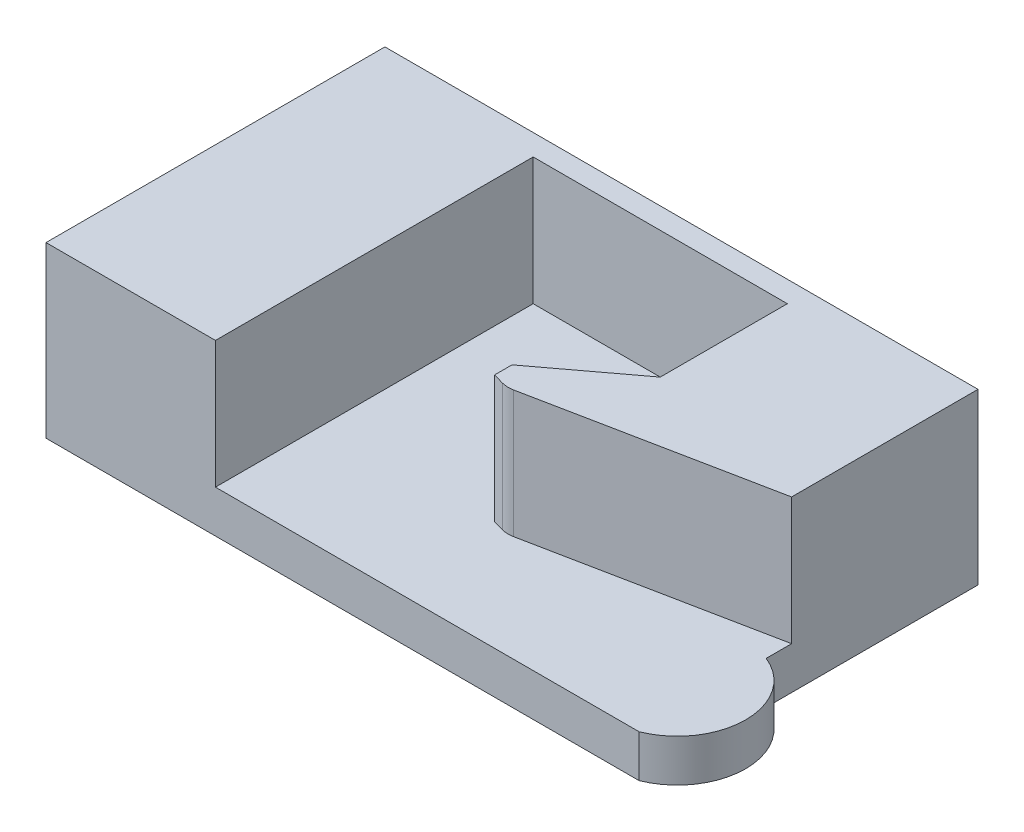
ISO-10303-21;
HEADER;
FILE_DESCRIPTION(('STEP AP214'),'2;1');
FILE_NAME('part.step','',(''),(''),'','','');
FILE_SCHEMA(('AUTOMOTIVE_DESIGN { 1 0 10303 214 1 1 1 1 }'));
ENDSEC;
DATA;
#1=APPLICATION_CONTEXT('core data for automotive mechanical design processes');
#2=APPLICATION_PROTOCOL_DEFINITION('international standard','automotive_design',2000,#1);
#3=PRODUCT_CONTEXT('',#1,'mechanical');
#4=PRODUCT('Part','Part','',(#3));
#5=PRODUCT_RELATED_PRODUCT_CATEGORY('part','',(#4));
#6=PRODUCT_DEFINITION_FORMATION('','',#4);
#7=PRODUCT_DEFINITION_CONTEXT('part definition',#1,'design');
#8=PRODUCT_DEFINITION('design','',#6,#7);
#9=PRODUCT_DEFINITION_SHAPE('','',#8);
#10=(LENGTH_UNIT() NAMED_UNIT(*) SI_UNIT(.MILLI.,.METRE.));
#11=(NAMED_UNIT(*) PLANE_ANGLE_UNIT() SI_UNIT($,.RADIAN.));
#12=(NAMED_UNIT(*) SI_UNIT($,.STERADIAN.) SOLID_ANGLE_UNIT());
#13=UNCERTAINTY_MEASURE_WITH_UNIT(LENGTH_MEASURE(1.E-05),#10,'distance_accuracy_value','');
#14=(GEOMETRIC_REPRESENTATION_CONTEXT(3) GLOBAL_UNCERTAINTY_ASSIGNED_CONTEXT((#13)) GLOBAL_UNIT_ASSIGNED_CONTEXT((#10,
#11,#12)) REPRESENTATION_CONTEXT('',''));
#15=CARTESIAN_POINT('',(0.,0.,0.));
#16=DIRECTION('',(0.,0.,1.));
#17=DIRECTION('',(1.,0.,0.));
#18=AXIS2_PLACEMENT_3D('',#15,#16,#17);
#19=CARTESIAN_POINT('',(0.,20.,0.));
#20=DIRECTION('',(1.,0.,0.));
#21=DIRECTION('',(0.,0.,-1.));
#22=AXIS2_PLACEMENT_3D('',#19,#20,#21);
#23=PLANE('',#22);
#24=DIRECTION('',(0.,0.,1.));
#25=VECTOR('',#24,1.);
#26=CARTESIAN_POINT('',(0.,0.,0.));
#27=LINE('',#26,#25);
#28=CARTESIAN_POINT('',(0.,0.,-40.));
#29=VERTEX_POINT('',#28);
#30=CARTESIAN_POINT('',(0.,0.,0.));
#31=VERTEX_POINT('',#30);
#32=EDGE_CURVE('E156',#29,#31,#27,.T.);
#33=ORIENTED_EDGE('',*,*,#32,.T.);
#34=DIRECTION('',(0.,-1.,0.));
#35=VECTOR('',#34,1.);
#36=CARTESIAN_POINT('',(0.,20.,0.));
#37=LINE('',#36,#35);
#38=CARTESIAN_POINT('',(0.,20.,0.));
#39=VERTEX_POINT('',#38);
#40=EDGE_CURVE('E141',#39,#31,#37,.T.);
#41=ORIENTED_EDGE('',*,*,#40,.F.);
#42=DIRECTION('',(0.,0.,1.));
#43=VECTOR('',#42,1.);
#44=CARTESIAN_POINT('',(0.,20.,0.));
#45=LINE('',#44,#43);
#46=CARTESIAN_POINT('',(0.,20.,-40.));
#47=VERTEX_POINT('',#46);
#48=EDGE_CURVE('E165',#47,#39,#45,.T.);
#49=ORIENTED_EDGE('',*,*,#48,.F.);
#50=DIRECTION('',(0.,-1.,0.));
#51=VECTOR('',#50,1.);
#52=CARTESIAN_POINT('',(0.,20.,-40.));
#53=LINE('',#52,#51);
#54=EDGE_CURVE('E166',#47,#29,#53,.T.);
#55=ORIENTED_EDGE('',*,*,#54,.T.);
#56=EDGE_LOOP('',(#33,#41,#49,#55));
#57=FACE_BOUND('',#56,.T.);
#58=ADVANCED_FACE('F33',(#57),#23,.F.);
#59=CARTESIAN_POINT('',(0.,20.,0.));
#60=DIRECTION('',(0.,0.,-1.));
#61=DIRECTION('',(-1.,0.,0.));
#62=AXIS2_PLACEMENT_3D('',#59,#60,#61);
#63=PLANE('',#62);
#64=DIRECTION('',(0.,-1.,0.));
#65=VECTOR('',#64,1.);
#66=CARTESIAN_POINT('',(70.,20.,0.));
#67=LINE('',#66,#65);
#68=CARTESIAN_POINT('',(70.,5.,0.));
#69=VERTEX_POINT('',#68);
#70=CARTESIAN_POINT('',(70.,0.,0.));
#71=VERTEX_POINT('',#70);
#72=EDGE_CURVE('E132',#69,#71,#67,.T.);
#73=ORIENTED_EDGE('',*,*,#72,.F.);
#74=DIRECTION('',(1.,0.,0.));
#75=VECTOR('',#74,1.);
#76=CARTESIAN_POINT('',(40.,5.,0.));
#77=LINE('',#76,#75);
#78=CARTESIAN_POINT('',(20.,5.,0.));
#79=VERTEX_POINT('',#78);
#80=EDGE_CURVE('E220',#79,#69,#77,.T.);
#81=ORIENTED_EDGE('',*,*,#80,.F.);
#82=DIRECTION('',(0.,1.,0.));
#83=VECTOR('',#82,1.);
#84=CARTESIAN_POINT('',(20.,-20.,0.));
#85=LINE('',#84,#83);
#86=CARTESIAN_POINT('',(20.,20.,0.));
#87=VERTEX_POINT('',#86);
#88=EDGE_CURVE('E217',#79,#87,#85,.T.);
#89=ORIENTED_EDGE('',*,*,#88,.T.);
#90=DIRECTION('',(1.,0.,0.));
#91=VECTOR('',#90,1.);
#92=CARTESIAN_POINT('',(0.,20.,0.));
#93=LINE('',#92,#91);
#94=EDGE_CURVE('E257',#39,#87,#93,.T.);
#95=ORIENTED_EDGE('',*,*,#94,.F.);
#96=ORIENTED_EDGE('',*,*,#40,.T.);
#97=DIRECTION('',(1.,0.,0.));
#98=VECTOR('',#97,1.);
#99=CARTESIAN_POINT('',(0.,0.,0.));
#100=LINE('',#99,#98);
#101=EDGE_CURVE('E148',#31,#71,#100,.T.);
#102=ORIENTED_EDGE('',*,*,#101,.T.);
#103=EDGE_LOOP('',(#73,#81,#89,#95,#96,#102));
#104=FACE_BOUND('',#103,.T.);
#105=ADVANCED_FACE('F153',(#104),#63,.F.);
#106=CARTESIAN_POINT('',(70.,20.,0.));
#107=DIRECTION('',(-1.,0.,0.));
#108=DIRECTION('',(0.,0.,1.));
#109=AXIS2_PLACEMENT_3D('',#106,#107,#108);
#110=PLANE('',#109);
#111=DIRECTION('',(0.,0.,-1.));
#112=VECTOR('',#111,1.);
#113=CARTESIAN_POINT('',(70.,5.,-18.));
#114=LINE('',#113,#112);
#115=CARTESIAN_POINT('',(70.,5.,-15.));
#116=VERTEX_POINT('',#115);
#117=CARTESIAN_POINT('',(70.,5.,-18.));
#118=VERTEX_POINT('',#117);
#119=EDGE_CURVE('E199',#116,#118,#114,.T.);
#120=ORIENTED_EDGE('',*,*,#119,.F.);
#121=DIRECTION('',(0.,-1.,0.));
#122=VECTOR('',#121,1.);
#123=CARTESIAN_POINT('',(70.,20.8361458927287,-15.));
#124=LINE('',#123,#122);
#125=CARTESIAN_POINT('',(70.,0.,-15.));
#126=VERTEX_POINT('',#125);
#127=EDGE_CURVE('E48',#116,#126,#124,.T.);
#128=ORIENTED_EDGE('',*,*,#127,.T.);
#129=DIRECTION('',(0.,0.,-1.));
#130=VECTOR('',#129,1.);
#131=CARTESIAN_POINT('',(70.,0.,0.));
#132=LINE('',#131,#130);
#133=CARTESIAN_POINT('',(70.,0.,-40.));
#134=VERTEX_POINT('',#133);
#135=EDGE_CURVE('E151',#126,#134,#132,.T.);
#136=ORIENTED_EDGE('',*,*,#135,.T.);
#137=DIRECTION('',(0.,-1.,0.));
#138=VECTOR('',#137,1.);
#139=CARTESIAN_POINT('',(70.,20.,-40.));
#140=LINE('',#139,#138);
#141=CARTESIAN_POINT('',(70.,20.,-40.));
#142=VERTEX_POINT('',#141);
#143=EDGE_CURVE('E142',#142,#134,#140,.T.);
#144=ORIENTED_EDGE('',*,*,#143,.F.);
#145=DIRECTION('',(0.,0.,-1.));
#146=VECTOR('',#145,1.);
#147=CARTESIAN_POINT('',(70.,20.,0.));
#148=LINE('',#147,#146);
#149=CARTESIAN_POINT('',(70.,20.,-18.));
#150=VERTEX_POINT('',#149);
#151=EDGE_CURVE('E260',#150,#142,#148,.T.);
#152=ORIENTED_EDGE('',*,*,#151,.F.);
#153=DIRECTION('',(0.,1.,0.));
#154=VECTOR('',#153,1.);
#155=CARTESIAN_POINT('',(70.,-29.9857113690718,-18.));
#156=LINE('',#155,#154);
#157=EDGE_CURVE('E198',#118,#150,#156,.T.);
#158=ORIENTED_EDGE('',*,*,#157,.F.);
#159=EDGE_LOOP('',(#120,#128,#136,#144,#152,#158));
#160=FACE_BOUND('',#159,.T.);
#161=ADVANCED_FACE('F273',(#160),#110,.F.);
#162=CARTESIAN_POINT('',(0.,20.,-40.));
#163=DIRECTION('',(0.,0.,1.));
#164=DIRECTION('',(1.,0.,0.));
#165=AXIS2_PLACEMENT_3D('',#162,#163,#164);
#166=PLANE('',#165);
#167=DIRECTION('',(-1.,0.,0.));
#168=VECTOR('',#167,1.);
#169=CARTESIAN_POINT('',(0.,0.,-40.));
#170=LINE('',#169,#168);
#171=EDGE_CURVE('E158',#134,#29,#170,.T.);
#172=ORIENTED_EDGE('',*,*,#171,.T.);
#173=ORIENTED_EDGE('',*,*,#54,.F.);
#174=DIRECTION('',(-1.,0.,0.));
#175=VECTOR('',#174,1.);
#176=CARTESIAN_POINT('',(0.,20.,-40.));
#177=LINE('',#176,#175);
#178=EDGE_CURVE('E169',#142,#47,#177,.T.);
#179=ORIENTED_EDGE('',*,*,#178,.F.);
#180=ORIENTED_EDGE('',*,*,#143,.T.);
#181=EDGE_LOOP('',(#172,#173,#179,#180));
#182=FACE_BOUND('',#181,.T.);
#183=ADVANCED_FACE('F266',(#182),#166,.F.);
#184=CARTESIAN_POINT('',(0.,20.,0.));
#185=DIRECTION('',(0.,-1.,0.));
#186=DIRECTION('',(0.,0.,-1.));
#187=AXIS2_PLACEMENT_3D('',#184,#185,#186);
#188=PLANE('',#187);
#189=DIRECTION('',(-0.962738641732021,0.,-0.270433555085132));
#190=VECTOR('',#189,1.);
#191=CARTESIAN_POINT('',(40.,20.,-12.9431230451554));
#192=LINE('',#191,#190);
#193=CARTESIAN_POINT('',(40.,20.,-12.9431230451554));
#194=VERTEX_POINT('',#193);
#195=CARTESIAN_POINT('',(41.2677620561054,20.,-12.5870083272318));
#196=VERTEX_POINT('',#195);
#197=EDGE_CURVE('E176',#194,#196,#192,.F.);
#198=ORIENTED_EDGE('',*,*,#197,.T.);
#199=CARTESIAN_POINT('',(42.0790627213607,20.,-15.4752242524278));
#200=DIRECTION('',(0.,-1.,0.));
#201=DIRECTION('',(0.,0.,-1.));
#202=AXIS2_PLACEMENT_3D('',#199,#200,#201);
#203=CIRCLE('',#202,3.);
#204=CARTESIAN_POINT('',(42.6674111267753,20.,-12.5334822253551));
#205=VERTEX_POINT('',#204);
#206=EDGE_CURVE('E41',#196,#205,#203,.F.);
#207=ORIENTED_EDGE('',*,*,#206,.T.);
#208=DIRECTION('',(-0.98058067569092,0.,0.196116135138184));
#209=VECTOR('',#208,1.);
#210=CARTESIAN_POINT('',(40.,20.,-12.));
#211=LINE('',#210,#209);
#212=EDGE_CURVE('E188',#150,#205,#211,.T.);
#213=ORIENTED_EDGE('',*,*,#212,.F.);
#214=ORIENTED_EDGE('',*,*,#151,.T.);
#215=ORIENTED_EDGE('',*,*,#178,.T.);
#216=ORIENTED_EDGE('',*,*,#48,.T.);
#217=ORIENTED_EDGE('',*,*,#94,.T.);
#218=DIRECTION('',(0.,0.,1.));
#219=VECTOR('',#218,1.);
#220=CARTESIAN_POINT('',(20.,20.,-15.));
#221=LINE('',#220,#219);
#222=CARTESIAN_POINT('',(20.,20.,-37.5));
#223=VERTEX_POINT('',#222);
#224=EDGE_CURVE('E232',#223,#87,#221,.T.);
#225=ORIENTED_EDGE('',*,*,#224,.F.);
#226=DIRECTION('',(-1.,0.,0.));
#227=VECTOR('',#226,1.);
#228=CARTESIAN_POINT('',(20.,20.,-37.5));
#229=LINE('',#228,#227);
#230=CARTESIAN_POINT('',(50.,20.,-37.5));
#231=VERTEX_POINT('',#230);
#232=EDGE_CURVE('E245',#231,#223,#229,.T.);
#233=ORIENTED_EDGE('',*,*,#232,.F.);
#234=DIRECTION('',(0.,0.,-1.));
#235=VECTOR('',#234,1.);
#236=CARTESIAN_POINT('',(50.,20.,-37.5));
#237=LINE('',#236,#235);
#238=CARTESIAN_POINT('',(50.,20.,-22.5));
#239=VERTEX_POINT('',#238);
#240=EDGE_CURVE('E242',#239,#231,#237,.T.);
#241=ORIENTED_EDGE('',*,*,#240,.F.);
#242=DIRECTION('',(0.8,0.,-0.6));
#243=VECTOR('',#242,1.);
#244=CARTESIAN_POINT('',(50.,20.,-22.5));
#245=LINE('',#244,#243);
#246=CARTESIAN_POINT('',(40.,20.,-15.));
#247=VERTEX_POINT('',#246);
#248=EDGE_CURVE('E216',#247,#239,#245,.T.);
#249=ORIENTED_EDGE('',*,*,#248,.F.);
#250=DIRECTION('',(0.,0.,-1.));
#251=VECTOR('',#250,1.);
#252=CARTESIAN_POINT('',(40.,20.,-15.));
#253=LINE('',#252,#251);
#254=EDGE_CURVE('E210',#194,#247,#253,.T.);
#255=ORIENTED_EDGE('',*,*,#254,.F.);
#256=EDGE_LOOP('',(#198,#207,#213,#214,#215,#216,#217,#225,#233,#241,#249,#255));
#257=FACE_BOUND('',#256,.T.);
#258=ADVANCED_FACE('F187',(#257),#188,.F.);
#259=CARTESIAN_POINT('',(0.,0.,0.));
#260=DIRECTION('',(0.,-1.,0.));
#261=DIRECTION('',(0.,0.,-1.));
#262=AXIS2_PLACEMENT_3D('',#259,#260,#261);
#263=PLANE('',#262);
#264=ORIENTED_EDGE('',*,*,#32,.F.);
#265=ORIENTED_EDGE('',*,*,#171,.F.);
#266=ORIENTED_EDGE('',*,*,#135,.F.);
#267=CARTESIAN_POINT('',(67.,0.,-7.5));
#268=DIRECTION('',(0.,-1.,0.));
#269=DIRECTION('',(0.,0.,1.));
#270=AXIS2_PLACEMENT_3D('',#267,#268,#269);
#271=CIRCLE('',#270,8.07774721070176);
#272=EDGE_CURVE('E135',#126,#71,#271,.T.);
#273=ORIENTED_EDGE('',*,*,#272,.T.);
#274=ORIENTED_EDGE('',*,*,#101,.F.);
#275=EDGE_LOOP('',(#264,#265,#266,#273,#274));
#276=FACE_BOUND('',#275,.T.);
#277=ADVANCED_FACE('F147',(#276),#263,.T.);
#278=CARTESIAN_POINT('',(20.,5.,-15.));
#279=DIRECTION('',(-1.,0.,0.));
#280=DIRECTION('',(0.,0.,1.));
#281=AXIS2_PLACEMENT_3D('',#278,#279,#280);
#282=PLANE('',#281);
#283=ORIENTED_EDGE('',*,*,#224,.T.);
#284=ORIENTED_EDGE('',*,*,#88,.F.);
#285=DIRECTION('',(0.,0.,1.));
#286=VECTOR('',#285,1.);
#287=CARTESIAN_POINT('',(20.,5.,-15.));
#288=LINE('',#287,#286);
#289=CARTESIAN_POINT('',(20.,5.,-37.5));
#290=VERTEX_POINT('',#289);
#291=EDGE_CURVE('E238',#290,#79,#288,.T.);
#292=ORIENTED_EDGE('',*,*,#291,.F.);
#293=DIRECTION('',(0.,1.,0.));
#294=VECTOR('',#293,1.);
#295=CARTESIAN_POINT('',(20.,5.,-37.5));
#296=LINE('',#295,#294);
#297=EDGE_CURVE('E160',#290,#223,#296,.T.);
#298=ORIENTED_EDGE('',*,*,#297,.T.);
#299=EDGE_LOOP('',(#283,#284,#292,#298));
#300=FACE_BOUND('',#299,.T.);
#301=ADVANCED_FACE('F291',(#300),#282,.F.);
#302=CARTESIAN_POINT('',(20.,5.,-37.5));
#303=DIRECTION('',(0.,0.,-1.));
#304=DIRECTION('',(-1.,0.,0.));
#305=AXIS2_PLACEMENT_3D('',#302,#303,#304);
#306=PLANE('',#305);
#307=ORIENTED_EDGE('',*,*,#232,.T.);
#308=ORIENTED_EDGE('',*,*,#297,.F.);
#309=DIRECTION('',(-1.,0.,0.));
#310=VECTOR('',#309,1.);
#311=CARTESIAN_POINT('',(20.,5.,-37.5));
#312=LINE('',#311,#310);
#313=CARTESIAN_POINT('',(50.,5.,-37.5));
#314=VERTEX_POINT('',#313);
#315=EDGE_CURVE('E235',#314,#290,#312,.T.);
#316=ORIENTED_EDGE('',*,*,#315,.F.);
#317=DIRECTION('',(0.,1.,0.));
#318=VECTOR('',#317,1.);
#319=CARTESIAN_POINT('',(50.,5.,-37.5));
#320=LINE('',#319,#318);
#321=EDGE_CURVE('E250',#314,#231,#320,.T.);
#322=ORIENTED_EDGE('',*,*,#321,.T.);
#323=EDGE_LOOP('',(#307,#308,#316,#322));
#324=FACE_BOUND('',#323,.T.);
#325=ADVANCED_FACE('F294',(#324),#306,.F.);
#326=CARTESIAN_POINT('',(50.,5.,-37.5));
#327=DIRECTION('',(1.,0.,0.));
#328=DIRECTION('',(0.,0.,-1.));
#329=AXIS2_PLACEMENT_3D('',#326,#327,#328);
#330=PLANE('',#329);
#331=ORIENTED_EDGE('',*,*,#240,.T.);
#332=ORIENTED_EDGE('',*,*,#321,.F.);
#333=DIRECTION('',(0.,0.,-1.));
#334=VECTOR('',#333,1.);
#335=CARTESIAN_POINT('',(50.,5.,-37.5));
#336=LINE('',#335,#334);
#337=CARTESIAN_POINT('',(50.,5.,-22.5));
#338=VERTEX_POINT('',#337);
#339=EDGE_CURVE('E231',#338,#314,#336,.T.);
#340=ORIENTED_EDGE('',*,*,#339,.F.);
#341=DIRECTION('',(0.,1.,0.));
#342=VECTOR('',#341,1.);
#343=CARTESIAN_POINT('',(50.,5.,-22.5));
#344=LINE('',#343,#342);
#345=EDGE_CURVE('E252',#338,#239,#344,.T.);
#346=ORIENTED_EDGE('',*,*,#345,.T.);
#347=EDGE_LOOP('',(#331,#332,#340,#346));
#348=FACE_BOUND('',#347,.T.);
#349=ADVANCED_FACE('F298',(#348),#330,.F.);
#350=CARTESIAN_POINT('',(50.,5.,-22.5));
#351=DIRECTION('',(0.6,0.,0.8));
#352=DIRECTION('',(0.8,0.,-0.6));
#353=AXIS2_PLACEMENT_3D('',#350,#351,#352);
#354=PLANE('',#353);
#355=ORIENTED_EDGE('',*,*,#248,.T.);
#356=ORIENTED_EDGE('',*,*,#345,.F.);
#357=DIRECTION('',(0.8,0.,-0.6));
#358=VECTOR('',#357,1.);
#359=CARTESIAN_POINT('',(50.,5.,-22.5));
#360=LINE('',#359,#358);
#361=CARTESIAN_POINT('',(40.,5.,-15.));
#362=VERTEX_POINT('',#361);
#363=EDGE_CURVE('E228',#362,#338,#360,.T.);
#364=ORIENTED_EDGE('',*,*,#363,.F.);
#365=DIRECTION('',(0.,1.,0.));
#366=VECTOR('',#365,1.);
#367=CARTESIAN_POINT('',(40.,5.,-15.));
#368=LINE('',#367,#366);
#369=EDGE_CURVE('E240',#362,#247,#368,.T.);
#370=ORIENTED_EDGE('',*,*,#369,.T.);
#371=EDGE_LOOP('',(#355,#356,#364,#370));
#372=FACE_BOUND('',#371,.T.);
#373=ADVANCED_FACE('F290',(#372),#354,.F.);
#374=CARTESIAN_POINT('',(0.,5.,0.));
#375=DIRECTION('',(0.,-1.,0.));
#376=DIRECTION('',(0.,0.,-1.));
#377=AXIS2_PLACEMENT_3D('',#374,#375,#376);
#378=PLANE('',#377);
#379=ORIENTED_EDGE('',*,*,#291,.T.);
#380=ORIENTED_EDGE('',*,*,#80,.T.);
#381=CARTESIAN_POINT('',(67.,5.,-7.5));
#382=DIRECTION('',(0.,-1.,0.));
#383=DIRECTION('',(0.,0.,-1.));
#384=AXIS2_PLACEMENT_3D('',#381,#382,#383);
#385=CIRCLE('',#384,8.07774721070176);
#386=EDGE_CURVE('E136',#69,#116,#385,.F.);
#387=ORIENTED_EDGE('',*,*,#386,.T.);
#388=ORIENTED_EDGE('',*,*,#119,.T.);
#389=DIRECTION('',(-0.98058067569092,0.,0.196116135138184));
#390=VECTOR('',#389,1.);
#391=CARTESIAN_POINT('',(40.,5.,-12.));
#392=LINE('',#391,#390);
#393=CARTESIAN_POINT('',(42.6674111267753,5.,-12.5334822253551));
#394=VERTEX_POINT('',#393);
#395=EDGE_CURVE('E204',#118,#394,#392,.T.);
#396=ORIENTED_EDGE('',*,*,#395,.T.);
#397=CARTESIAN_POINT('',(42.0790627213607,5.,-15.4752242524278));
#398=DIRECTION('',(0.,-1.,0.));
#399=DIRECTION('',(0.,0.,-1.));
#400=AXIS2_PLACEMENT_3D('',#397,#398,#399);
#401=CIRCLE('',#400,3.);
#402=CARTESIAN_POINT('',(41.2677620561054,5.,-12.5870083272318));
#403=VERTEX_POINT('',#402);
#404=EDGE_CURVE('E11',#394,#403,#401,.T.);
#405=ORIENTED_EDGE('',*,*,#404,.T.);
#406=DIRECTION('',(0.962738641732021,0.,0.270433555085132));
#407=VECTOR('',#406,1.);
#408=CARTESIAN_POINT('',(6.29520284029526,5.,-22.410810041622));
#409=LINE('',#408,#407);
#410=CARTESIAN_POINT('',(40.,5.,-12.9431230451554));
#411=VERTEX_POINT('',#410);
#412=EDGE_CURVE('E178',#403,#411,#409,.F.);
#413=ORIENTED_EDGE('',*,*,#412,.T.);
#414=DIRECTION('',(0.,0.,-1.));
#415=VECTOR('',#414,1.);
#416=CARTESIAN_POINT('',(40.,5.,-15.));
#417=LINE('',#416,#415);
#418=EDGE_CURVE('E212',#411,#362,#417,.T.);
#419=ORIENTED_EDGE('',*,*,#418,.T.);
#420=ORIENTED_EDGE('',*,*,#363,.T.);
#421=ORIENTED_EDGE('',*,*,#339,.T.);
#422=ORIENTED_EDGE('',*,*,#315,.T.);
#423=EDGE_LOOP('',(#379,#380,#387,#388,#396,#405,#413,#419,#420,#421,#422));
#424=FACE_BOUND('',#423,.T.);
#425=ADVANCED_FACE('F202',(#424),#378,.F.);
#426=CARTESIAN_POINT('',(40.,-20.,-15.));
#427=DIRECTION('',(1.,0.,0.));
#428=DIRECTION('',(0.,0.,-1.));
#429=AXIS2_PLACEMENT_3D('',#426,#427,#428);
#430=PLANE('',#429);
#431=ORIENTED_EDGE('',*,*,#418,.F.);
#432=DIRECTION('',(0.,1.,0.));
#433=VECTOR('',#432,1.);
#434=CARTESIAN_POINT('',(40.,-20.,-12.9431230451554));
#435=LINE('',#434,#433);
#436=EDGE_CURVE('E173',#411,#194,#435,.T.);
#437=ORIENTED_EDGE('',*,*,#436,.T.);
#438=ORIENTED_EDGE('',*,*,#254,.T.);
#439=ORIENTED_EDGE('',*,*,#369,.F.);
#440=EDGE_LOOP('',(#431,#437,#438,#439));
#441=FACE_BOUND('',#440,.T.);
#442=ADVANCED_FACE('F208',(#441),#430,.F.);
#443=CARTESIAN_POINT('',(40.,-29.9857113690718,-12.));
#444=DIRECTION('',(-0.196116135138184,0.,-0.98058067569092));
#445=DIRECTION('',(-0.98058067569092,0.,0.196116135138184));
#446=AXIS2_PLACEMENT_3D('',#443,#444,#445);
#447=PLANE('',#446);
#448=ORIENTED_EDGE('',*,*,#212,.T.);
#449=DIRECTION('',(0.,1.,0.));
#450=VECTOR('',#449,1.);
#451=CARTESIAN_POINT('',(42.6674111267753,5.,-12.5334822253551));
#452=LINE('',#451,#450);
#453=EDGE_CURVE('E180',#205,#394,#452,.F.);
#454=ORIENTED_EDGE('',*,*,#453,.T.);
#455=ORIENTED_EDGE('',*,*,#395,.F.);
#456=ORIENTED_EDGE('',*,*,#157,.T.);
#457=EDGE_LOOP('',(#448,#454,#455,#456));
#458=FACE_BOUND('',#457,.T.);
#459=ADVANCED_FACE('F194',(#458),#447,.F.);
#460=CARTESIAN_POINT('',(40.,-20.,-12.9431230451554));
#461=DIRECTION('',(0.270433555085132,0.,-0.962738641732021));
#462=DIRECTION('',(0.,1.,0.));
#463=AXIS2_PLACEMENT_3D('',#460,#461,#462);
#464=PLANE('',#463);
#465=ORIENTED_EDGE('',*,*,#412,.F.);
#466=DIRECTION('',(0.,-1.,0.));
#467=VECTOR('',#466,1.);
#468=CARTESIAN_POINT('',(41.2677620561054,20.,-12.5870083272318));
#469=LINE('',#468,#467);
#470=EDGE_CURVE('E56',#403,#196,#469,.F.);
#471=ORIENTED_EDGE('',*,*,#470,.T.);
#472=ORIENTED_EDGE('',*,*,#197,.F.);
#473=ORIENTED_EDGE('',*,*,#436,.F.);
#474=EDGE_LOOP('',(#465,#471,#472,#473));
#475=FACE_BOUND('',#474,.T.);
#476=ADVANCED_FACE('F206',(#475),#464,.F.);
#477=CARTESIAN_POINT('',(42.0790627213607,-29.9857113690718,-15.4752242524278));
#478=DIRECTION('',(0.,-1.,0.));
#479=DIRECTION('',(0.,0.,-1.));
#480=AXIS2_PLACEMENT_3D('',#477,#478,#479);
#481=CYLINDRICAL_SURFACE('',#480,3.);
#482=ORIENTED_EDGE('',*,*,#206,.F.);
#483=ORIENTED_EDGE('',*,*,#470,.F.);
#484=ORIENTED_EDGE('',*,*,#404,.F.);
#485=ORIENTED_EDGE('',*,*,#453,.F.);
#486=EDGE_LOOP('',(#482,#483,#484,#485));
#487=FACE_BOUND('',#486,.T.);
#488=ADVANCED_FACE('F35',(#487),#481,.T.);
#489=CARTESIAN_POINT('',(67.,20.8361458927287,-7.5));
#490=DIRECTION('',(0.,-1.,0.));
#491=DIRECTION('',(0.,0.,-1.));
#492=AXIS2_PLACEMENT_3D('',#489,#490,#491);
#493=CYLINDRICAL_SURFACE('',#492,8.07774721070176);
#494=ORIENTED_EDGE('',*,*,#386,.F.);
#495=ORIENTED_EDGE('',*,*,#72,.T.);
#496=ORIENTED_EDGE('',*,*,#272,.F.);
#497=ORIENTED_EDGE('',*,*,#127,.F.);
#498=EDGE_LOOP('',(#494,#495,#496,#497));
#499=FACE_BOUND('',#498,.T.);
#500=ADVANCED_FACE('F134',(#499),#493,.T.);
#501=CLOSED_SHELL('',(#58,#105,#161,#183,#258,#277,#301,#325,#349,#373,#425,#442,#459,#476,#488,#500));
#502=MANIFOLD_SOLID_BREP('B2',#501);
#503=ADVANCED_BREP_SHAPE_REPRESENTATION('',(#18,#502),#14);
#504=SHAPE_DEFINITION_REPRESENTATION(#9,#503);
ENDSEC;
END-ISO-10303-21;
